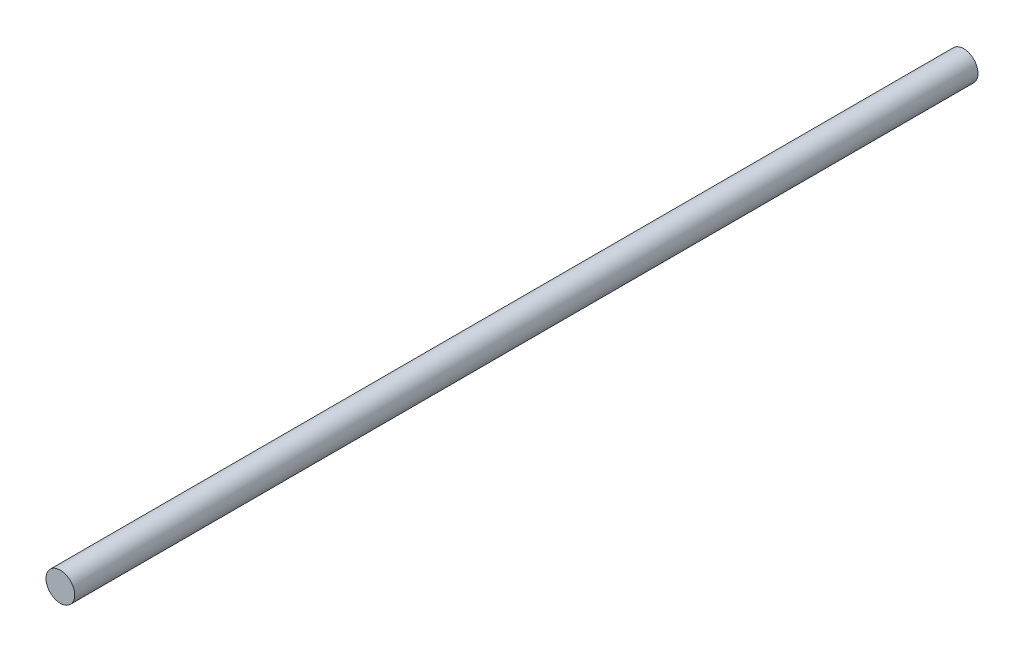
ISO-10303-21;
HEADER;
FILE_DESCRIPTION(('STEP AP214'),'2;1');
FILE_NAME('part.step','',(''),(''),'','','');
FILE_SCHEMA(('AUTOMOTIVE_DESIGN { 1 0 10303 214 1 1 1 1 }'));
ENDSEC;
DATA;
#1=APPLICATION_CONTEXT('core data for automotive mechanical design processes');
#2=APPLICATION_PROTOCOL_DEFINITION('international standard','automotive_design',2000,#1);
#3=PRODUCT_CONTEXT('',#1,'mechanical');
#4=PRODUCT('Part','Part','',(#3));
#5=PRODUCT_RELATED_PRODUCT_CATEGORY('part','',(#4));
#6=PRODUCT_DEFINITION_FORMATION('','',#4);
#7=PRODUCT_DEFINITION_CONTEXT('part definition',#1,'design');
#8=PRODUCT_DEFINITION('design','',#6,#7);
#9=PRODUCT_DEFINITION_SHAPE('','',#8);
#10=(LENGTH_UNIT() NAMED_UNIT(*) SI_UNIT(.MILLI.,.METRE.));
#11=(NAMED_UNIT(*) PLANE_ANGLE_UNIT() SI_UNIT($,.RADIAN.));
#12=(NAMED_UNIT(*) SI_UNIT($,.STERADIAN.) SOLID_ANGLE_UNIT());
#13=UNCERTAINTY_MEASURE_WITH_UNIT(LENGTH_MEASURE(1.E-05),#10,'distance_accuracy_value','');
#14=(GEOMETRIC_REPRESENTATION_CONTEXT(3) GLOBAL_UNCERTAINTY_ASSIGNED_CONTEXT((#13)) GLOBAL_UNIT_ASSIGNED_CONTEXT((#10,
#11,#12)) REPRESENTATION_CONTEXT('',''));
#15=CARTESIAN_POINT('',(0.,0.,0.));
#16=DIRECTION('',(0.,0.,1.));
#17=DIRECTION('',(1.,0.,0.));
#18=AXIS2_PLACEMENT_3D('',#15,#16,#17);
#19=CARTESIAN_POINT('',(0.,0.,251.5));
#20=DIRECTION('',(0.,0.,-1.));
#21=DIRECTION('',(-1.,0.,0.));
#22=AXIS2_PLACEMENT_3D('',#19,#20,#21);
#23=CYLINDRICAL_SURFACE('',#22,4.);
#24=CARTESIAN_POINT('',(0.,0.,251.5));
#25=DIRECTION('',(0.,0.,1.));
#26=DIRECTION('',(1.,0.,0.));
#27=AXIS2_PLACEMENT_3D('',#24,#25,#26);
#28=CIRCLE('',#27,4.);
#29=CARTESIAN_POINT('',(4.,0.,251.5));
#30=VERTEX_POINT('',#29);
#31=EDGE_CURVE('E10',#30,#30,#28,.T.);
#32=ORIENTED_EDGE('',*,*,#31,.F.);
#33=EDGE_LOOP('',(#32));
#34=FACE_BOUND('',#33,.T.);
#35=CARTESIAN_POINT('',(0.,0.,0.));
#36=DIRECTION('',(0.,0.,1.));
#37=DIRECTION('',(1.,0.,0.));
#38=AXIS2_PLACEMENT_3D('',#35,#36,#37);
#39=CIRCLE('',#38,4.);
#40=CARTESIAN_POINT('',(4.,0.,0.));
#41=VERTEX_POINT('',#40);
#42=EDGE_CURVE('E36',#41,#41,#39,.T.);
#43=ORIENTED_EDGE('',*,*,#42,.T.);
#44=EDGE_LOOP('',(#43));
#45=FACE_BOUND('',#44,.T.);
#46=ADVANCED_FACE('F33',(#34,#45),#23,.T.);
#47=CARTESIAN_POINT('',(0.,0.,251.5));
#48=DIRECTION('',(0.,0.,1.));
#49=DIRECTION('',(1.,0.,0.));
#50=AXIS2_PLACEMENT_3D('',#47,#48,#49);
#51=PLANE('',#50);
#52=ORIENTED_EDGE('',*,*,#31,.T.);
#53=EDGE_LOOP('',(#52));
#54=FACE_BOUND('',#53,.T.);
#55=ADVANCED_FACE('F48',(#54),#51,.T.);
#56=CARTESIAN_POINT('',(0.,0.,0.));
#57=DIRECTION('',(0.,0.,1.));
#58=DIRECTION('',(1.,0.,0.));
#59=AXIS2_PLACEMENT_3D('',#56,#57,#58);
#60=PLANE('',#59);
#61=ORIENTED_EDGE('',*,*,#42,.F.);
#62=EDGE_LOOP('',(#61));
#63=FACE_BOUND('',#62,.T.);
#64=ADVANCED_FACE('F46',(#63),#60,.F.);
#65=CLOSED_SHELL('',(#46,#55,#64));
#66=MANIFOLD_SOLID_BREP('B2',#65);
#67=ADVANCED_BREP_SHAPE_REPRESENTATION('',(#18,#66),#14);
#68=SHAPE_DEFINITION_REPRESENTATION(#9,#67);
ENDSEC;
END-ISO-10303-21;
